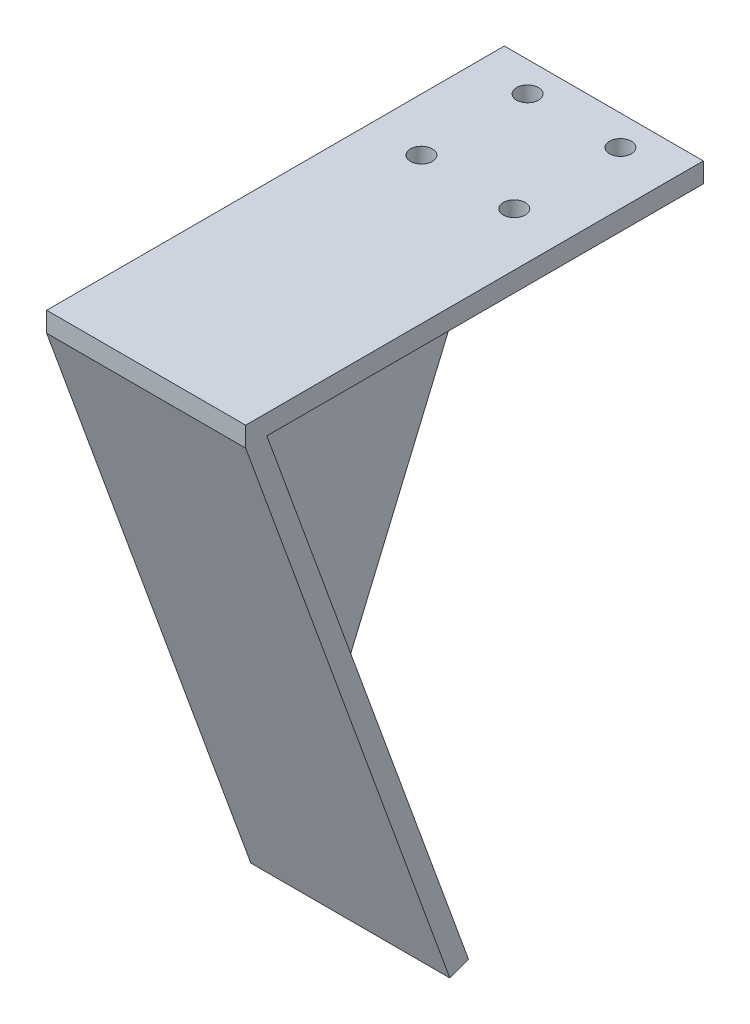
ISO-10303-21;
HEADER;
FILE_DESCRIPTION(('STEP AP214'),'2;1');
FILE_NAME('part.step','',(''),(''),'','','');
FILE_SCHEMA(('AUTOMOTIVE_DESIGN { 1 0 10303 214 1 1 1 1 }'));
ENDSEC;
DATA;
#1=APPLICATION_CONTEXT('core data for automotive mechanical design processes');
#2=APPLICATION_PROTOCOL_DEFINITION('international standard','automotive_design',2000,#1);
#3=PRODUCT_CONTEXT('',#1,'mechanical');
#4=PRODUCT('Part','Part','',(#3));
#5=PRODUCT_RELATED_PRODUCT_CATEGORY('part','',(#4));
#6=PRODUCT_DEFINITION_FORMATION('','',#4);
#7=PRODUCT_DEFINITION_CONTEXT('part definition',#1,'design');
#8=PRODUCT_DEFINITION('design','',#6,#7);
#9=PRODUCT_DEFINITION_SHAPE('','',#8);
#10=(LENGTH_UNIT() NAMED_UNIT(*) SI_UNIT(.MILLI.,.METRE.));
#11=(NAMED_UNIT(*) PLANE_ANGLE_UNIT() SI_UNIT($,.RADIAN.));
#12=(NAMED_UNIT(*) SI_UNIT($,.STERADIAN.) SOLID_ANGLE_UNIT());
#13=UNCERTAINTY_MEASURE_WITH_UNIT(LENGTH_MEASURE(1.E-05),#10,'distance_accuracy_value','');
#14=(GEOMETRIC_REPRESENTATION_CONTEXT(3) GLOBAL_UNCERTAINTY_ASSIGNED_CONTEXT((#13)) GLOBAL_UNIT_ASSIGNED_CONTEXT((#10,
#11,#12)) REPRESENTATION_CONTEXT('',''));
#15=CARTESIAN_POINT('',(0.,0.,0.));
#16=DIRECTION('',(0.,0.,1.));
#17=DIRECTION('',(1.,0.,0.));
#18=AXIS2_PLACEMENT_3D('',#15,#16,#17);
#19=CARTESIAN_POINT('',(-15.,3.,28.));
#20=DIRECTION('',(1.,0.,0.));
#21=DIRECTION('',(0.,0.,-1.));
#22=AXIS2_PLACEMENT_3D('',#19,#20,#21);
#23=PLANE('',#22);
#24=DIRECTION('',(0.,-1.,0.));
#25=VECTOR('',#24,1.);
#26=CARTESIAN_POINT('',(-15.,3.,-30.));
#27=LINE('',#26,#25);
#28=CARTESIAN_POINT('',(-15.,3.,-30.));
#29=VERTEX_POINT('',#28);
#30=CARTESIAN_POINT('',(-15.,0.,-30.));
#31=VERTEX_POINT('',#30);
#32=EDGE_CURVE('E146',#29,#31,#27,.T.);
#33=ORIENTED_EDGE('',*,*,#32,.T.);
#34=DIRECTION('',(0.,-0.920759064294808,0.390131702786314));
#35=VECTOR('',#34,1.);
#36=CARTESIAN_POINT('',(-15.,-83.5462754407546,5.39910923833175));
#37=LINE('',#36,#35);
#38=CARTESIAN_POINT('',(-15.,-83.5462754407546,5.39910923833175));
#39=VERTEX_POINT('',#38);
#40=EDGE_CURVE('E105',#31,#39,#37,.T.);
#41=ORIENTED_EDGE('',*,*,#40,.T.);
#42=DIRECTION('',(0.,-0.342020143325674,0.939692620785907));
#43=VECTOR('',#42,1.);
#44=CARTESIAN_POINT('',(-15.,-84.5723358707316,8.21818710068947));
#45=LINE('',#44,#43);
#46=CARTESIAN_POINT('',(-15.,-84.5723358707316,8.21818710068947));
#47=VERTEX_POINT('',#46);
#48=EDGE_CURVE('E128',#39,#47,#45,.T.);
#49=ORIENTED_EDGE('',*,*,#48,.T.);
#50=DIRECTION('',(0.,0.939692620785907,0.342020143325673));
#51=VECTOR('',#50,1.);
#52=CARTESIAN_POINT('',(-15.,0.,39.));
#53=LINE('',#52,#51);
#54=CARTESIAN_POINT('',(-15.,0.,39.));
#55=VERTEX_POINT('',#54);
#56=EDGE_CURVE('E239',#47,#55,#53,.T.);
#57=ORIENTED_EDGE('',*,*,#56,.T.);
#58=DIRECTION('',(0.,-1.,0.));
#59=VECTOR('',#58,1.);
#60=CARTESIAN_POINT('',(-15.,3.,39.));
#61=LINE('',#60,#59);
#62=CARTESIAN_POINT('',(-15.,3.,39.));
#63=VERTEX_POINT('',#62);
#64=EDGE_CURVE('E228',#63,#55,#61,.T.);
#65=ORIENTED_EDGE('',*,*,#64,.F.);
#66=DIRECTION('',(0.,0.,1.));
#67=VECTOR('',#66,1.);
#68=CARTESIAN_POINT('',(-15.,3.,28.));
#69=LINE('',#68,#67);
#70=EDGE_CURVE('E134',#29,#63,#69,.T.);
#71=ORIENTED_EDGE('',*,*,#70,.F.);
#72=EDGE_LOOP('',(#33,#41,#49,#57,#65,#71));
#73=FACE_BOUND('',#72,.T.);
#74=ADVANCED_FACE('F39',(#73),#23,.F.);
#75=CARTESIAN_POINT('',(15.,3.,28.));
#76=DIRECTION('',(-1.,0.,0.));
#77=DIRECTION('',(0.,0.,1.));
#78=AXIS2_PLACEMENT_3D('',#75,#76,#77);
#79=PLANE('',#78);
#80=DIRECTION('',(0.,1.,0.));
#81=VECTOR('',#80,1.);
#82=CARTESIAN_POINT('',(15.,0.,39.));
#83=LINE('',#82,#81);
#84=CARTESIAN_POINT('',(15.,0.,39.));
#85=VERTEX_POINT('',#84);
#86=CARTESIAN_POINT('',(15.,3.,39.));
#87=VERTEX_POINT('',#86);
#88=EDGE_CURVE('E221',#85,#87,#83,.T.);
#89=ORIENTED_EDGE('',*,*,#88,.F.);
#90=DIRECTION('',(0.,-0.939692620785907,-0.342020143325673));
#91=VECTOR('',#90,1.);
#92=CARTESIAN_POINT('',(15.,0.,39.));
#93=LINE('',#92,#91);
#94=CARTESIAN_POINT('',(15.,-84.5723358707316,8.21818710068947));
#95=VERTEX_POINT('',#94);
#96=EDGE_CURVE('E235',#85,#95,#93,.T.);
#97=ORIENTED_EDGE('',*,*,#96,.T.);
#98=DIRECTION('',(0.,0.342020143325674,-0.939692620785907));
#99=VECTOR('',#98,1.);
#100=CARTESIAN_POINT('',(15.,-84.5723358707316,8.21818710068947));
#101=LINE('',#100,#99);
#102=CARTESIAN_POINT('',(15.,-83.5462754407546,5.39910923833175));
#103=VERTEX_POINT('',#102);
#104=EDGE_CURVE('E246',#95,#103,#101,.T.);
#105=ORIENTED_EDGE('',*,*,#104,.T.);
#106=DIRECTION('',(0.,0.939692620785907,0.342020143325673));
#107=VECTOR('',#106,1.);
#108=CARTESIAN_POINT('',(15.,-83.5462754407546,5.39910923833175));
#109=LINE('',#108,#107);
#110=CARTESIAN_POINT('',(15.,0.,35.8074666825723));
#111=VERTEX_POINT('',#110);
#112=EDGE_CURVE('E232',#103,#111,#109,.T.);
#113=ORIENTED_EDGE('',*,*,#112,.T.);
#114=DIRECTION('',(0.,0.,-1.));
#115=VECTOR('',#114,1.);
#116=CARTESIAN_POINT('',(15.,0.,28.));
#117=LINE('',#116,#115);
#118=CARTESIAN_POINT('',(15.,0.,-30.));
#119=VERTEX_POINT('',#118);
#120=EDGE_CURVE('E135',#111,#119,#117,.T.);
#121=ORIENTED_EDGE('',*,*,#120,.T.);
#122=DIRECTION('',(0.,-1.,0.));
#123=VECTOR('',#122,1.);
#124=CARTESIAN_POINT('',(15.,3.,-30.));
#125=LINE('',#124,#123);
#126=CARTESIAN_POINT('',(15.,3.,-30.));
#127=VERTEX_POINT('',#126);
#128=EDGE_CURVE('E48',#127,#119,#125,.T.);
#129=ORIENTED_EDGE('',*,*,#128,.F.);
#130=DIRECTION('',(0.,0.,-1.));
#131=VECTOR('',#130,1.);
#132=CARTESIAN_POINT('',(15.,3.,28.));
#133=LINE('',#132,#131);
#134=EDGE_CURVE('E139',#87,#127,#133,.T.);
#135=ORIENTED_EDGE('',*,*,#134,.F.);
#136=EDGE_LOOP('',(#89,#97,#105,#113,#121,#129,#135));
#137=FACE_BOUND('',#136,.T.);
#138=ADVANCED_FACE('F189',(#137),#79,.F.);
#139=CARTESIAN_POINT('',(15.,3.,-30.));
#140=DIRECTION('',(0.,0.,1.));
#141=DIRECTION('',(1.,0.,0.));
#142=AXIS2_PLACEMENT_3D('',#139,#140,#141);
#143=PLANE('',#142);
#144=DIRECTION('',(-1.,0.,0.));
#145=VECTOR('',#144,1.);
#146=CARTESIAN_POINT('',(15.,0.,-30.));
#147=LINE('',#146,#145);
#148=CARTESIAN_POINT('',(-12.,0.,-30.));
#149=VERTEX_POINT('',#148);
#150=EDGE_CURVE('E124',#119,#149,#147,.T.);
#151=ORIENTED_EDGE('',*,*,#150,.T.);
#152=DIRECTION('',(-1.,0.,0.));
#153=VECTOR('',#152,1.);
#154=CARTESIAN_POINT('',(-12.,0.,-30.));
#155=LINE('',#154,#153);
#156=EDGE_CURVE('E99',#149,#31,#155,.T.);
#157=ORIENTED_EDGE('',*,*,#156,.T.);
#158=ORIENTED_EDGE('',*,*,#32,.F.);
#159=DIRECTION('',(-1.,0.,0.));
#160=VECTOR('',#159,1.);
#161=CARTESIAN_POINT('',(15.,3.,-30.));
#162=LINE('',#161,#160);
#163=EDGE_CURVE('E55',#127,#29,#162,.T.);
#164=ORIENTED_EDGE('',*,*,#163,.F.);
#165=ORIENTED_EDGE('',*,*,#128,.T.);
#166=EDGE_LOOP('',(#151,#157,#158,#164,#165));
#167=FACE_BOUND('',#166,.T.);
#168=ADVANCED_FACE('F131',(#167),#143,.F.);
#169=CARTESIAN_POINT('',(0.,3.,0.));
#170=DIRECTION('',(0.,1.,0.));
#171=DIRECTION('',(0.,0.,1.));
#172=AXIS2_PLACEMENT_3D('',#169,#170,#171);
#173=PLANE('',#172);
#174=ORIENTED_EDGE('',*,*,#163,.T.);
#175=ORIENTED_EDGE('',*,*,#70,.T.);
#176=DIRECTION('',(-1.,0.,0.));
#177=VECTOR('',#176,1.);
#178=CARTESIAN_POINT('',(15.,3.,39.));
#179=LINE('',#178,#177);
#180=EDGE_CURVE('E218',#87,#63,#179,.T.);
#181=ORIENTED_EDGE('',*,*,#180,.F.);
#182=ORIENTED_EDGE('',*,*,#134,.T.);
#183=EDGE_LOOP('',(#174,#175,#181,#182));
#184=FACE_BOUND('',#183,.T.);
#185=CARTESIAN_POINT('',(7.,3.,-9.49999999999998));
#186=DIRECTION('',(0.,1.,0.));
#187=DIRECTION('',(0.,0.,1.));
#188=AXIS2_PLACEMENT_3D('',#185,#186,#187);
#189=CIRCLE('',#188,1.65);
#190=CARTESIAN_POINT('',(7.,3.,-7.84999999999998));
#191=VERTEX_POINT('',#190);
#192=EDGE_CURVE('E207',#191,#191,#189,.T.);
#193=ORIENTED_EDGE('',*,*,#192,.F.);
#194=EDGE_LOOP('',(#193));
#195=FACE_BOUND('',#194,.T.);
#196=CARTESIAN_POINT('',(-7.,3.,-25.5));
#197=DIRECTION('',(0.,1.,0.));
#198=DIRECTION('',(0.,0.,1.));
#199=AXIS2_PLACEMENT_3D('',#196,#197,#198);
#200=CIRCLE('',#199,1.65);
#201=CARTESIAN_POINT('',(-7.,3.,-23.85));
#202=VERTEX_POINT('',#201);
#203=EDGE_CURVE('E208',#202,#202,#200,.T.);
#204=ORIENTED_EDGE('',*,*,#203,.F.);
#205=EDGE_LOOP('',(#204));
#206=FACE_BOUND('',#205,.T.);
#207=CARTESIAN_POINT('',(7.,3.,-25.5));
#208=DIRECTION('',(0.,1.,0.));
#209=DIRECTION('',(0.,0.,1.));
#210=AXIS2_PLACEMENT_3D('',#207,#208,#209);
#211=CIRCLE('',#210,1.65);
#212=CARTESIAN_POINT('',(7.,3.,-23.85));
#213=VERTEX_POINT('',#212);
#214=EDGE_CURVE('E212',#213,#213,#211,.T.);
#215=ORIENTED_EDGE('',*,*,#214,.F.);
#216=EDGE_LOOP('',(#215));
#217=FACE_BOUND('',#216,.T.);
#218=CARTESIAN_POINT('',(-7.,3.,-9.49999999999998));
#219=DIRECTION('',(0.,1.,0.));
#220=DIRECTION('',(0.,0.,1.));
#221=AXIS2_PLACEMENT_3D('',#218,#219,#220);
#222=CIRCLE('',#221,1.65);
#223=CARTESIAN_POINT('',(-7.,3.,-7.84999999999998));
#224=VERTEX_POINT('',#223);
#225=EDGE_CURVE('E156',#224,#224,#222,.T.);
#226=ORIENTED_EDGE('',*,*,#225,.F.);
#227=EDGE_LOOP('',(#226));
#228=FACE_BOUND('',#227,.T.);
#229=ADVANCED_FACE('F270',(#184,#195,#206,#217,#228),#173,.T.);
#230=CARTESIAN_POINT('',(0.,0.,0.));
#231=DIRECTION('',(0.,1.,0.));
#232=DIRECTION('',(0.,0.,1.));
#233=AXIS2_PLACEMENT_3D('',#230,#231,#232);
#234=PLANE('',#233);
#235=CARTESIAN_POINT('',(7.,0.,-9.49999999999998));
#236=DIRECTION('',(0.,1.,0.));
#237=DIRECTION('',(0.,0.,1.));
#238=AXIS2_PLACEMENT_3D('',#235,#236,#237);
#239=CIRCLE('',#238,1.65);
#240=CARTESIAN_POINT('',(7.,0.,-7.84999999999998));
#241=VERTEX_POINT('',#240);
#242=EDGE_CURVE('E142',#241,#241,#239,.T.);
#243=ORIENTED_EDGE('',*,*,#242,.T.);
#244=EDGE_LOOP('',(#243));
#245=FACE_BOUND('',#244,.T.);
#246=CARTESIAN_POINT('',(-7.,0.,-25.5));
#247=DIRECTION('',(0.,1.,0.));
#248=DIRECTION('',(0.,0.,1.));
#249=AXIS2_PLACEMENT_3D('',#246,#247,#248);
#250=CIRCLE('',#249,1.65);
#251=CARTESIAN_POINT('',(-7.,0.,-23.85));
#252=VERTEX_POINT('',#251);
#253=EDGE_CURVE('E160',#252,#252,#250,.T.);
#254=ORIENTED_EDGE('',*,*,#253,.T.);
#255=EDGE_LOOP('',(#254));
#256=FACE_BOUND('',#255,.T.);
#257=CARTESIAN_POINT('',(7.,0.,-25.5));
#258=DIRECTION('',(0.,1.,0.));
#259=DIRECTION('',(0.,0.,1.));
#260=AXIS2_PLACEMENT_3D('',#257,#258,#259);
#261=CIRCLE('',#260,1.65);
#262=CARTESIAN_POINT('',(7.,0.,-23.85));
#263=VERTEX_POINT('',#262);
#264=EDGE_CURVE('E155',#263,#263,#261,.T.);
#265=ORIENTED_EDGE('',*,*,#264,.T.);
#266=EDGE_LOOP('',(#265));
#267=FACE_BOUND('',#266,.T.);
#268=CARTESIAN_POINT('',(-7.,0.,-9.49999999999998));
#269=DIRECTION('',(0.,1.,0.));
#270=DIRECTION('',(0.,0.,1.));
#271=AXIS2_PLACEMENT_3D('',#268,#269,#270);
#272=CIRCLE('',#271,1.65);
#273=CARTESIAN_POINT('',(-7.,0.,-7.84999999999998));
#274=VERTEX_POINT('',#273);
#275=EDGE_CURVE('E151',#274,#274,#272,.T.);
#276=ORIENTED_EDGE('',*,*,#275,.T.);
#277=EDGE_LOOP('',(#276));
#278=FACE_BOUND('',#277,.T.);
#279=DIRECTION('',(-1.,0.,0.));
#280=VECTOR('',#279,1.);
#281=CARTESIAN_POINT('',(106.002746412454,0.,35.8074666825723));
#282=LINE('',#281,#280);
#283=CARTESIAN_POINT('',(-12.,0.,35.8074666825723));
#284=VERTEX_POINT('',#283);
#285=EDGE_CURVE('E126',#111,#284,#282,.T.);
#286=ORIENTED_EDGE('',*,*,#285,.T.);
#287=DIRECTION('',(0.,0.,-1.));
#288=VECTOR('',#287,1.);
#289=CARTESIAN_POINT('',(-12.,0.,0.));
#290=LINE('',#289,#288);
#291=EDGE_CURVE('E115',#284,#149,#290,.T.);
#292=ORIENTED_EDGE('',*,*,#291,.T.);
#293=ORIENTED_EDGE('',*,*,#150,.F.);
#294=ORIENTED_EDGE('',*,*,#120,.F.);
#295=EDGE_LOOP('',(#286,#292,#293,#294));
#296=FACE_BOUND('',#295,.T.);
#297=ADVANCED_FACE('F122',(#245,#256,#267,#278,#296),#234,.F.);
#298=CARTESIAN_POINT('',(-7.,-1.,-9.49999999999998));
#299=DIRECTION('',(0.,1.,0.));
#300=DIRECTION('',(0.,0.,1.));
#301=AXIS2_PLACEMENT_3D('',#298,#299,#300);
#302=CYLINDRICAL_SURFACE('',#301,1.65);
#303=ORIENTED_EDGE('',*,*,#225,.T.);
#304=EDGE_LOOP('',(#303));
#305=FACE_BOUND('',#304,.T.);
#306=ORIENTED_EDGE('',*,*,#275,.F.);
#307=EDGE_LOOP('',(#306));
#308=FACE_BOUND('',#307,.T.);
#309=ADVANCED_FACE('F282',(#305,#308),#302,.F.);
#310=CARTESIAN_POINT('',(7.,-1.,-25.5));
#311=DIRECTION('',(0.,1.,0.));
#312=DIRECTION('',(0.,0.,1.));
#313=AXIS2_PLACEMENT_3D('',#310,#311,#312);
#314=CYLINDRICAL_SURFACE('',#313,1.65);
#315=ORIENTED_EDGE('',*,*,#214,.T.);
#316=EDGE_LOOP('',(#315));
#317=FACE_BOUND('',#316,.T.);
#318=ORIENTED_EDGE('',*,*,#264,.F.);
#319=EDGE_LOOP('',(#318));
#320=FACE_BOUND('',#319,.T.);
#321=ADVANCED_FACE('F183',(#317,#320),#314,.F.);
#322=CARTESIAN_POINT('',(-7.,-1.,-25.5));
#323=DIRECTION('',(0.,1.,0.));
#324=DIRECTION('',(0.,0.,1.));
#325=AXIS2_PLACEMENT_3D('',#322,#323,#324);
#326=CYLINDRICAL_SURFACE('',#325,1.65);
#327=ORIENTED_EDGE('',*,*,#203,.T.);
#328=EDGE_LOOP('',(#327));
#329=FACE_BOUND('',#328,.T.);
#330=ORIENTED_EDGE('',*,*,#253,.F.);
#331=EDGE_LOOP('',(#330));
#332=FACE_BOUND('',#331,.T.);
#333=ADVANCED_FACE('F172',(#329,#332),#326,.F.);
#334=CARTESIAN_POINT('',(7.,-1.,-9.49999999999998));
#335=DIRECTION('',(0.,1.,0.));
#336=DIRECTION('',(0.,0.,1.));
#337=AXIS2_PLACEMENT_3D('',#334,#335,#336);
#338=CYLINDRICAL_SURFACE('',#337,1.65);
#339=ORIENTED_EDGE('',*,*,#192,.T.);
#340=EDGE_LOOP('',(#339));
#341=FACE_BOUND('',#340,.T.);
#342=ORIENTED_EDGE('',*,*,#242,.F.);
#343=EDGE_LOOP('',(#342));
#344=FACE_BOUND('',#343,.T.);
#345=ADVANCED_FACE('F169',(#341,#344),#338,.F.);
#346=CARTESIAN_POINT('',(0.,0.,39.));
#347=DIRECTION('',(0.,0.,1.));
#348=DIRECTION('',(1.,0.,0.));
#349=AXIS2_PLACEMENT_3D('',#346,#347,#348);
#350=PLANE('',#349);
#351=ORIENTED_EDGE('',*,*,#180,.T.);
#352=ORIENTED_EDGE('',*,*,#64,.T.);
#353=DIRECTION('',(1.,0.,0.));
#354=VECTOR('',#353,1.);
#355=CARTESIAN_POINT('',(-15.,0.,39.));
#356=LINE('',#355,#354);
#357=EDGE_CURVE('E225',#55,#85,#356,.T.);
#358=ORIENTED_EDGE('',*,*,#357,.T.);
#359=ORIENTED_EDGE('',*,*,#88,.T.);
#360=EDGE_LOOP('',(#351,#352,#358,#359));
#361=FACE_BOUND('',#360,.T.);
#362=ADVANCED_FACE('F171',(#361),#350,.T.);
#363=CARTESIAN_POINT('',(106.002746412454,0.,39.));
#364=DIRECTION('',(0.,-0.342020143325673,0.939692620785907));
#365=DIRECTION('',(0.,-0.939692620785907,-0.342020143325673));
#366=AXIS2_PLACEMENT_3D('',#363,#364,#365);
#367=PLANE('',#366);
#368=ORIENTED_EDGE('',*,*,#96,.F.);
#369=ORIENTED_EDGE('',*,*,#357,.F.);
#370=ORIENTED_EDGE('',*,*,#56,.F.);
#371=DIRECTION('',(-1.,0.,0.));
#372=VECTOR('',#371,1.);
#373=CARTESIAN_POINT('',(106.002746412454,-84.5723358707316,8.21818710068947));
#374=LINE('',#373,#372);
#375=EDGE_CURVE('E243',#95,#47,#374,.T.);
#376=ORIENTED_EDGE('',*,*,#375,.F.);
#377=EDGE_LOOP('',(#368,#369,#370,#376));
#378=FACE_BOUND('',#377,.T.);
#379=ADVANCED_FACE('F180',(#378),#367,.T.);
#380=CARTESIAN_POINT('',(106.002746412454,-84.5723358707316,8.21818710068947));
#381=DIRECTION('',(0.,-0.939692620785907,-0.342020143325674));
#382=DIRECTION('',(0.,0.342020143325674,-0.939692620785907));
#383=AXIS2_PLACEMENT_3D('',#380,#381,#382);
#384=PLANE('',#383);
#385=ORIENTED_EDGE('',*,*,#375,.T.);
#386=ORIENTED_EDGE('',*,*,#48,.F.);
#387=DIRECTION('',(-1.,0.,0.));
#388=VECTOR('',#387,1.);
#389=CARTESIAN_POINT('',(-12.,-83.5462754407546,5.39910923833175));
#390=LINE('',#389,#388);
#391=CARTESIAN_POINT('',(-12.,-83.5462754407546,5.39910923833175));
#392=VERTEX_POINT('',#391);
#393=EDGE_CURVE('E110',#392,#39,#390,.T.);
#394=ORIENTED_EDGE('',*,*,#393,.F.);
#395=DIRECTION('',(-1.,0.,0.));
#396=VECTOR('',#395,1.);
#397=CARTESIAN_POINT('',(106.002746412454,-83.5462754407546,5.39910923833175));
#398=LINE('',#397,#396);
#399=EDGE_CURVE('E238',#103,#392,#398,.T.);
#400=ORIENTED_EDGE('',*,*,#399,.F.);
#401=ORIENTED_EDGE('',*,*,#104,.F.);
#402=EDGE_LOOP('',(#385,#386,#394,#400,#401));
#403=FACE_BOUND('',#402,.T.);
#404=ADVANCED_FACE('F262',(#403),#384,.T.);
#405=CARTESIAN_POINT('',(106.002746412454,-83.5462754407546,5.39910923833175));
#406=DIRECTION('',(0.,0.342020143325673,-0.939692620785907));
#407=DIRECTION('',(0.,0.939692620785907,0.342020143325673));
#408=AXIS2_PLACEMENT_3D('',#405,#406,#407);
#409=PLANE('',#408);
#410=DIRECTION('',(0.,-0.939692620785907,-0.342020143325673));
#411=VECTOR('',#410,1.);
#412=CARTESIAN_POINT('',(-12.,-83.5462754407546,5.39910923833175));
#413=LINE('',#412,#411);
#414=EDGE_CURVE('E11',#284,#392,#413,.T.);
#415=ORIENTED_EDGE('',*,*,#414,.F.);
#416=ORIENTED_EDGE('',*,*,#285,.F.);
#417=ORIENTED_EDGE('',*,*,#112,.F.);
#418=ORIENTED_EDGE('',*,*,#399,.T.);
#419=EDGE_LOOP('',(#415,#416,#417,#418));
#420=FACE_BOUND('',#419,.T.);
#421=ADVANCED_FACE('F360',(#420),#409,.T.);
#422=CARTESIAN_POINT('',(-12.,0.,0.));
#423=DIRECTION('',(1.,0.,0.));
#424=DIRECTION('',(0.,0.,-1.));
#425=AXIS2_PLACEMENT_3D('',#422,#423,#424);
#426=PLANE('',#425);
#427=ORIENTED_EDGE('',*,*,#291,.F.);
#428=ORIENTED_EDGE('',*,*,#414,.T.);
#429=DIRECTION('',(0.,-0.920759064294808,0.390131702786314));
#430=VECTOR('',#429,1.);
#431=CARTESIAN_POINT('',(-12.,-83.5462754407546,5.39910923833175));
#432=LINE('',#431,#430);
#433=EDGE_CURVE('E103',#149,#392,#432,.T.);
#434=ORIENTED_EDGE('',*,*,#433,.F.);
#435=EDGE_LOOP('',(#427,#428,#434));
#436=FACE_BOUND('',#435,.T.);
#437=ADVANCED_FACE('F114',(#436),#426,.T.);
#438=CARTESIAN_POINT('',(-12.,-83.5462754407546,5.39910923833175));
#439=DIRECTION('',(0.,-0.390131702786314,-0.920759064294808));
#440=DIRECTION('',(0.,0.920759064294808,-0.390131702786314));
#441=AXIS2_PLACEMENT_3D('',#438,#439,#440);
#442=PLANE('',#441);
#443=ORIENTED_EDGE('',*,*,#40,.F.);
#444=ORIENTED_EDGE('',*,*,#156,.F.);
#445=ORIENTED_EDGE('',*,*,#433,.T.);
#446=ORIENTED_EDGE('',*,*,#393,.T.);
#447=EDGE_LOOP('',(#443,#444,#445,#446));
#448=FACE_BOUND('',#447,.T.);
#449=ADVANCED_FACE('F101',(#448),#442,.T.);
#450=CLOSED_SHELL('',(#74,#138,#168,#229,#297,#309,#321,#333,#345,#362,#379,#404,#421,#437,#449));
#451=MANIFOLD_SOLID_BREP('B2',#450);
#452=ADVANCED_BREP_SHAPE_REPRESENTATION('',(#18,#451),#14);
#453=SHAPE_DEFINITION_REPRESENTATION(#9,#452);
ENDSEC;
END-ISO-10303-21;
